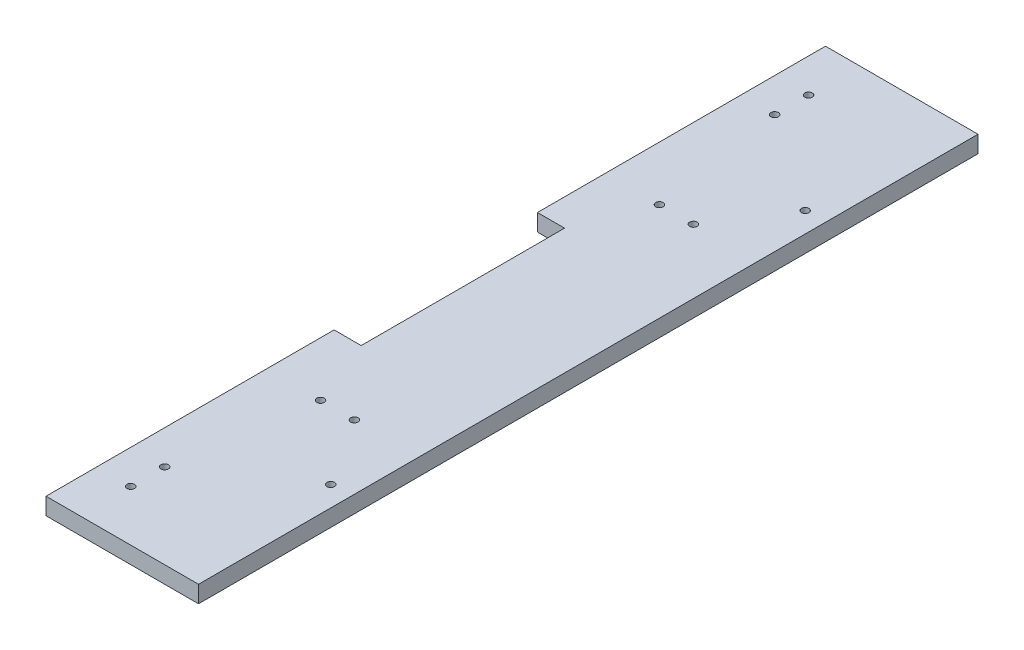
ISO-10303-21;
HEADER;
FILE_DESCRIPTION(('STEP AP214'),'2;1');
FILE_NAME('part.step','',(''),(''),'','','');
FILE_SCHEMA(('AUTOMOTIVE_DESIGN { 1 0 10303 214 1 1 1 1 }'));
ENDSEC;
DATA;
#1=APPLICATION_CONTEXT('core data for automotive mechanical design processes');
#2=APPLICATION_PROTOCOL_DEFINITION('international standard','automotive_design',2000,#1);
#3=PRODUCT_CONTEXT('',#1,'mechanical');
#4=PRODUCT('Part','Part','',(#3));
#5=PRODUCT_RELATED_PRODUCT_CATEGORY('part','',(#4));
#6=PRODUCT_DEFINITION_FORMATION('','',#4);
#7=PRODUCT_DEFINITION_CONTEXT('part definition',#1,'design');
#8=PRODUCT_DEFINITION('design','',#6,#7);
#9=PRODUCT_DEFINITION_SHAPE('','',#8);
#10=(LENGTH_UNIT() NAMED_UNIT(*) SI_UNIT(.MILLI.,.METRE.));
#11=(NAMED_UNIT(*) PLANE_ANGLE_UNIT() SI_UNIT($,.RADIAN.));
#12=(NAMED_UNIT(*) SI_UNIT($,.STERADIAN.) SOLID_ANGLE_UNIT());
#13=UNCERTAINTY_MEASURE_WITH_UNIT(LENGTH_MEASURE(1.E-05),#10,'distance_accuracy_value','');
#14=(GEOMETRIC_REPRESENTATION_CONTEXT(3) GLOBAL_UNCERTAINTY_ASSIGNED_CONTEXT((#13)) GLOBAL_UNIT_ASSIGNED_CONTEXT((#10,
#11,#12)) REPRESENTATION_CONTEXT('',''));
#15=CARTESIAN_POINT('',(0.,0.,0.));
#16=DIRECTION('',(0.,0.,1.));
#17=DIRECTION('',(1.,0.,0.));
#18=AXIS2_PLACEMENT_3D('',#15,#16,#17);
#19=CARTESIAN_POINT('',(-160.,0.,0.));
#20=DIRECTION('',(1.,0.,0.));
#21=DIRECTION('',(0.,0.,-1.));
#22=AXIS2_PLACEMENT_3D('',#19,#20,#21);
#23=PLANE('',#22);
#24=DIRECTION('',(0.,0.,-1.));
#25=VECTOR('',#24,1.);
#26=CARTESIAN_POINT('',(-160.,37.,115.));
#27=LINE('',#26,#25);
#28=CARTESIAN_POINT('',(-160.,37.,115.));
#29=VERTEX_POINT('',#28);
#30=CARTESIAN_POINT('',(-160.,37.0000000000001,30.));
#31=VERTEX_POINT('',#30);
#32=EDGE_CURVE('E219',#29,#31,#27,.T.);
#33=ORIENTED_EDGE('',*,*,#32,.T.);
#34=DIRECTION('',(0.,-1.,0.));
#35=VECTOR('',#34,1.);
#36=CARTESIAN_POINT('',(-160.,0.,30.));
#37=LINE('',#36,#35);
#38=CARTESIAN_POINT('',(-160.,31.999999999999,30.));
#39=VERTEX_POINT('',#38);
#40=EDGE_CURVE('E130',#31,#39,#37,.T.);
#41=ORIENTED_EDGE('',*,*,#40,.T.);
#42=DIRECTION('',(0.,0.,1.));
#43=VECTOR('',#42,1.);
#44=CARTESIAN_POINT('',(-160.,32.,-110.));
#45=LINE('',#44,#43);
#46=CARTESIAN_POINT('',(-160.,32.,115.));
#47=VERTEX_POINT('',#46);
#48=EDGE_CURVE('E213',#39,#47,#45,.T.);
#49=ORIENTED_EDGE('',*,*,#48,.T.);
#50=DIRECTION('',(0.,1.,0.));
#51=VECTOR('',#50,1.);
#52=CARTESIAN_POINT('',(-160.,0.,115.));
#53=LINE('',#52,#51);
#54=EDGE_CURVE('E216',#47,#29,#53,.T.);
#55=ORIENTED_EDGE('',*,*,#54,.T.);
#56=EDGE_LOOP('',(#33,#41,#49,#55));
#57=FACE_BOUND('',#56,.T.);
#58=ADVANCED_FACE('F37',(#57),#23,.F.);
#59=CARTESIAN_POINT('',(-110.,0.,-115.));
#60=DIRECTION('',(0.,0.,-1.));
#61=DIRECTION('',(-1.,0.,0.));
#62=AXIS2_PLACEMENT_3D('',#59,#60,#61);
#63=PLANE('',#62);
#64=DIRECTION('',(-1.,0.,0.));
#65=VECTOR('',#64,1.);
#66=CARTESIAN_POINT('',(-160.,32.,-115.));
#67=LINE('',#66,#65);
#68=CARTESIAN_POINT('',(-115.,32.,-115.));
#69=VERTEX_POINT('',#68);
#70=CARTESIAN_POINT('',(-160.,32.,-115.));
#71=VERTEX_POINT('',#70);
#72=EDGE_CURVE('E173',#69,#71,#67,.T.);
#73=ORIENTED_EDGE('',*,*,#72,.T.);
#74=DIRECTION('',(0.,-1.,0.));
#75=VECTOR('',#74,1.);
#76=CARTESIAN_POINT('',(-160.,0.,-115.));
#77=LINE('',#76,#75);
#78=CARTESIAN_POINT('',(-160.,37.,-115.));
#79=VERTEX_POINT('',#78);
#80=EDGE_CURVE('E207',#79,#71,#77,.T.);
#81=ORIENTED_EDGE('',*,*,#80,.F.);
#82=DIRECTION('',(1.,0.,0.));
#83=VECTOR('',#82,1.);
#84=CARTESIAN_POINT('',(-160.,37.,-115.));
#85=LINE('',#84,#83);
#86=CARTESIAN_POINT('',(-115.,37.,-115.));
#87=VERTEX_POINT('',#86);
#88=EDGE_CURVE('E210',#79,#87,#85,.T.);
#89=ORIENTED_EDGE('',*,*,#88,.T.);
#90=DIRECTION('',(0.,1.,0.));
#91=VECTOR('',#90,1.);
#92=CARTESIAN_POINT('',(-115.,-54.0487732352795,-115.));
#93=LINE('',#92,#91);
#94=EDGE_CURVE('E199',#69,#87,#93,.T.);
#95=ORIENTED_EDGE('',*,*,#94,.F.);
#96=EDGE_LOOP('',(#73,#81,#89,#95));
#97=FACE_BOUND('',#96,.T.);
#98=ADVANCED_FACE('F235',(#97),#63,.T.);
#99=CARTESIAN_POINT('',(-110.,0.,115.));
#100=DIRECTION('',(0.,0.,1.));
#101=DIRECTION('',(1.,0.,0.));
#102=AXIS2_PLACEMENT_3D('',#99,#100,#101);
#103=PLANE('',#102);
#104=DIRECTION('',(-1.,0.,0.));
#105=VECTOR('',#104,1.);
#106=CARTESIAN_POINT('',(-110.,32.,115.));
#107=LINE('',#106,#105);
#108=CARTESIAN_POINT('',(-115.,32.,115.));
#109=VERTEX_POINT('',#108);
#110=EDGE_CURVE('E196',#109,#47,#107,.T.);
#111=ORIENTED_EDGE('',*,*,#110,.F.);
#112=DIRECTION('',(0.,1.,0.));
#113=VECTOR('',#112,1.);
#114=CARTESIAN_POINT('',(-115.,-54.0487732352789,115.));
#115=LINE('',#114,#113);
#116=CARTESIAN_POINT('',(-115.,37.,115.));
#117=VERTEX_POINT('',#116);
#118=EDGE_CURVE('E200',#109,#117,#115,.T.);
#119=ORIENTED_EDGE('',*,*,#118,.T.);
#120=DIRECTION('',(1.,0.,0.));
#121=VECTOR('',#120,1.);
#122=CARTESIAN_POINT('',(-160.,37.,115.));
#123=LINE('',#122,#121);
#124=EDGE_CURVE('E45',#29,#117,#123,.T.);
#125=ORIENTED_EDGE('',*,*,#124,.F.);
#126=ORIENTED_EDGE('',*,*,#54,.F.);
#127=EDGE_LOOP('',(#111,#119,#125,#126));
#128=FACE_BOUND('',#127,.T.);
#129=ADVANCED_FACE('F39',(#128),#103,.T.);
#130=CARTESIAN_POINT('',(-160.,37.,115.));
#131=DIRECTION('',(0.,-1.,0.));
#132=DIRECTION('',(0.,0.,-1.));
#133=AXIS2_PLACEMENT_3D('',#130,#131,#132);
#134=PLANE('',#133);
#135=CARTESIAN_POINT('',(-134.,37.0000000000001,50.));
#136=DIRECTION('',(0.,1.,0.));
#137=DIRECTION('',(0.,0.,-1.));
#138=AXIS2_PLACEMENT_3D('',#135,#136,#137);
#139=CIRCLE('',#138,1.09999999999999);
#140=CARTESIAN_POINT('',(-134.,37.0000000000001,48.9000000000001));
#141=VERTEX_POINT('',#140);
#142=EDGE_CURVE('E133',#141,#141,#139,.T.);
#143=ORIENTED_EDGE('',*,*,#142,.F.);
#144=EDGE_LOOP('',(#143));
#145=FACE_BOUND('',#144,.T.);
#146=CARTESIAN_POINT('',(-144.,37.0000000000001,50.));
#147=DIRECTION('',(0.,1.,0.));
#148=DIRECTION('',(0.,0.,1.));
#149=AXIS2_PLACEMENT_3D('',#146,#147,#148);
#150=CIRCLE('',#149,1.09999999999999);
#151=CARTESIAN_POINT('',(-144.,37.0000000000001,51.1));
#152=VERTEX_POINT('',#151);
#153=EDGE_CURVE('E144',#152,#152,#150,.T.);
#154=ORIENTED_EDGE('',*,*,#153,.F.);
#155=EDGE_LOOP('',(#154));
#156=FACE_BOUND('',#155,.T.);
#157=CARTESIAN_POINT('',(-144.,37.0000000000002,-50.));
#158=DIRECTION('',(0.,1.,0.));
#159=DIRECTION('',(0.,0.,-1.));
#160=AXIS2_PLACEMENT_3D('',#157,#158,#159);
#161=CIRCLE('',#160,1.09999999999999);
#162=CARTESIAN_POINT('',(-144.,37.0000000000002,-51.0999999999999));
#163=VERTEX_POINT('',#162);
#164=EDGE_CURVE('E138',#163,#163,#161,.T.);
#165=ORIENTED_EDGE('',*,*,#164,.F.);
#166=EDGE_LOOP('',(#165));
#167=FACE_BOUND('',#166,.T.);
#168=CARTESIAN_POINT('',(-134.,37.0000000000002,-50.));
#169=DIRECTION('',(0.,1.,0.));
#170=DIRECTION('',(0.,0.,1.));
#171=AXIS2_PLACEMENT_3D('',#168,#169,#170);
#172=CIRCLE('',#171,1.09999999999999);
#173=CARTESIAN_POINT('',(-134.,37.0000000000002,-48.9));
#174=VERTEX_POINT('',#173);
#175=EDGE_CURVE('E137',#174,#174,#172,.T.);
#176=ORIENTED_EDGE('',*,*,#175,.F.);
#177=EDGE_LOOP('',(#176));
#178=FACE_BOUND('',#177,.T.);
#179=CARTESIAN_POINT('',(-121.,37.0000000000003,-70.));
#180=DIRECTION('',(0.,1.,0.));
#181=DIRECTION('',(0.,0.,1.));
#182=AXIS2_PLACEMENT_3D('',#179,#180,#181);
#183=CIRCLE('',#182,1.10000000000001);
#184=CARTESIAN_POINT('',(-121.,37.0000000000003,-68.8999999999999));
#185=VERTEX_POINT('',#184);
#186=EDGE_CURVE('E162',#185,#185,#183,.T.);
#187=ORIENTED_EDGE('',*,*,#186,.F.);
#188=EDGE_LOOP('',(#187));
#189=FACE_BOUND('',#188,.T.);
#190=CARTESIAN_POINT('',(-121.,37.0000000000001,69.9999999999999));
#191=DIRECTION('',(0.,1.,0.));
#192=DIRECTION('',(0.,0.,-1.));
#193=AXIS2_PLACEMENT_3D('',#190,#191,#192);
#194=CIRCLE('',#193,1.10000000000001);
#195=CARTESIAN_POINT('',(-121.,37.0000000000001,68.8999999999999));
#196=VERTEX_POINT('',#195);
#197=EDGE_CURVE('E155',#196,#196,#194,.T.);
#198=ORIENTED_EDGE('',*,*,#197,.F.);
#199=EDGE_LOOP('',(#198));
#200=FACE_BOUND('',#199,.T.);
#201=CARTESIAN_POINT('',(-150.,37.,100.));
#202=DIRECTION('',(0.,1.,0.));
#203=DIRECTION('',(0.,0.,1.));
#204=AXIS2_PLACEMENT_3D('',#201,#202,#203);
#205=CIRCLE('',#204,1.09999999999999);
#206=CARTESIAN_POINT('',(-150.,37.,101.1));
#207=VERTEX_POINT('',#206);
#208=EDGE_CURVE('E174',#207,#207,#205,.T.);
#209=ORIENTED_EDGE('',*,*,#208,.F.);
#210=EDGE_LOOP('',(#209));
#211=FACE_BOUND('',#210,.T.);
#212=CARTESIAN_POINT('',(-150.,37.,90.));
#213=DIRECTION('',(0.,1.,0.));
#214=DIRECTION('',(0.,0.,-1.));
#215=AXIS2_PLACEMENT_3D('',#212,#213,#214);
#216=CIRCLE('',#215,1.09999999999999);
#217=CARTESIAN_POINT('',(-150.,37.,88.9));
#218=VERTEX_POINT('',#217);
#219=EDGE_CURVE('E180',#218,#218,#216,.T.);
#220=ORIENTED_EDGE('',*,*,#219,.F.);
#221=EDGE_LOOP('',(#220));
#222=FACE_BOUND('',#221,.T.);
#223=CARTESIAN_POINT('',(-150.,37.0000000000003,-89.9999999999999));
#224=DIRECTION('',(0.,1.,0.));
#225=DIRECTION('',(0.,0.,1.));
#226=AXIS2_PLACEMENT_3D('',#223,#224,#225);
#227=CIRCLE('',#226,1.09999999999999);
#228=CARTESIAN_POINT('',(-150.,37.0000000000003,-88.8999999999999));
#229=VERTEX_POINT('',#228);
#230=EDGE_CURVE('E186',#229,#229,#227,.T.);
#231=ORIENTED_EDGE('',*,*,#230,.F.);
#232=EDGE_LOOP('',(#231));
#233=FACE_BOUND('',#232,.T.);
#234=CARTESIAN_POINT('',(-150.,37.0000000000003,-99.9999999999999));
#235=DIRECTION('',(0.,1.,0.));
#236=DIRECTION('',(0.,0.,-1.));
#237=AXIS2_PLACEMENT_3D('',#234,#235,#236);
#238=CIRCLE('',#237,1.09999999999999);
#239=CARTESIAN_POINT('',(-150.,37.0000000000003,-101.1));
#240=VERTEX_POINT('',#239);
#241=EDGE_CURVE('E161',#240,#240,#238,.T.);
#242=ORIENTED_EDGE('',*,*,#241,.F.);
#243=EDGE_LOOP('',(#242));
#244=FACE_BOUND('',#243,.T.);
#245=DIRECTION('',(0.,0.,-1.));
#246=VECTOR('',#245,1.);
#247=CARTESIAN_POINT('',(-152.,37.0000000000001,30.));
#248=LINE('',#247,#246);
#249=CARTESIAN_POINT('',(-152.,37.0000000000001,30.));
#250=VERTEX_POINT('',#249);
#251=CARTESIAN_POINT('',(-152.,37.0000000000002,-29.9999999999999));
#252=VERTEX_POINT('',#251);
#253=EDGE_CURVE('E109',#250,#252,#248,.T.);
#254=ORIENTED_EDGE('',*,*,#253,.F.);
#255=DIRECTION('',(1.,0.,0.));
#256=VECTOR('',#255,1.);
#257=CARTESIAN_POINT('',(-168.,37.0000000000001,30.));
#258=LINE('',#257,#256);
#259=EDGE_CURVE('E121',#31,#250,#258,.T.);
#260=ORIENTED_EDGE('',*,*,#259,.F.);
#261=ORIENTED_EDGE('',*,*,#32,.F.);
#262=ORIENTED_EDGE('',*,*,#124,.T.);
#263=DIRECTION('',(0.,0.,1.));
#264=VECTOR('',#263,1.);
#265=CARTESIAN_POINT('',(-115.,37.,-115.));
#266=LINE('',#265,#264);
#267=EDGE_CURVE('E204',#87,#117,#266,.T.);
#268=ORIENTED_EDGE('',*,*,#267,.F.);
#269=ORIENTED_EDGE('',*,*,#88,.F.);
#270=CARTESIAN_POINT('',(-160.,37.0000000000002,-29.9999999999999));
#271=VERTEX_POINT('',#270);
#272=EDGE_CURVE('E218',#271,#79,#27,.T.);
#273=ORIENTED_EDGE('',*,*,#272,.F.);
#274=DIRECTION('',(-1.,0.,0.));
#275=VECTOR('',#274,1.);
#276=CARTESIAN_POINT('',(-168.,37.0000000000002,-29.9999999999999));
#277=LINE('',#276,#275);
#278=EDGE_CURVE('E123',#252,#271,#277,.T.);
#279=ORIENTED_EDGE('',*,*,#278,.F.);
#280=EDGE_LOOP('',(#254,#260,#261,#262,#268,#269,#273,#279));
#281=FACE_BOUND('',#280,.T.);
#282=ADVANCED_FACE('F226',(#145,#156,#167,#178,#189,#200,#211,#222,#233,#244,#281),#134,.F.);
#283=CARTESIAN_POINT('',(-160.,32.,-30.));
#284=VERTEX_POINT('',#283);
#285=EDGE_CURVE('E214',#71,#284,#45,.T.);
#286=ORIENTED_EDGE('',*,*,#285,.T.);
#287=DIRECTION('',(0.,1.,0.));
#288=VECTOR('',#287,1.);
#289=CARTESIAN_POINT('',(-160.,0.,-30.));
#290=LINE('',#289,#288);
#291=EDGE_CURVE('E52',#284,#271,#290,.T.);
#292=ORIENTED_EDGE('',*,*,#291,.T.);
#293=ORIENTED_EDGE('',*,*,#272,.T.);
#294=ORIENTED_EDGE('',*,*,#80,.T.);
#295=EDGE_LOOP('',(#286,#292,#293,#294));
#296=FACE_BOUND('',#295,.T.);
#297=ADVANCED_FACE('F239',(#296),#23,.F.);
#298=CARTESIAN_POINT('',(-110.,32.,-110.));
#299=DIRECTION('',(0.,-1.,0.));
#300=DIRECTION('',(0.,0.,-1.));
#301=AXIS2_PLACEMENT_3D('',#298,#299,#300);
#302=PLANE('',#301);
#303=DIRECTION('',(-1.,0.,0.));
#304=VECTOR('',#303,1.);
#305=CARTESIAN_POINT('',(-110.,32.,30.));
#306=LINE('',#305,#304);
#307=CARTESIAN_POINT('',(-152.,31.999999999999,30.));
#308=VERTEX_POINT('',#307);
#309=EDGE_CURVE('E12',#308,#39,#306,.T.);
#310=ORIENTED_EDGE('',*,*,#309,.F.);
#311=DIRECTION('',(0.,0.,-1.));
#312=VECTOR('',#311,1.);
#313=CARTESIAN_POINT('',(-152.,31.999999999999,30.));
#314=LINE('',#313,#312);
#315=CARTESIAN_POINT('',(-152.,31.9999999999991,-30.));
#316=VERTEX_POINT('',#315);
#317=EDGE_CURVE('E106',#308,#316,#314,.T.);
#318=ORIENTED_EDGE('',*,*,#317,.T.);
#319=DIRECTION('',(-1.,0.,0.));
#320=VECTOR('',#319,1.);
#321=CARTESIAN_POINT('',(-168.,31.9999999999991,-30.));
#322=LINE('',#321,#320);
#323=EDGE_CURVE('E112',#316,#284,#322,.T.);
#324=ORIENTED_EDGE('',*,*,#323,.T.);
#325=ORIENTED_EDGE('',*,*,#285,.F.);
#326=ORIENTED_EDGE('',*,*,#72,.F.);
#327=DIRECTION('',(0.,0.,-1.));
#328=VECTOR('',#327,1.);
#329=CARTESIAN_POINT('',(-115.,32.,-110.));
#330=LINE('',#329,#328);
#331=EDGE_CURVE('E60',#109,#69,#330,.T.);
#332=ORIENTED_EDGE('',*,*,#331,.F.);
#333=ORIENTED_EDGE('',*,*,#110,.T.);
#334=ORIENTED_EDGE('',*,*,#48,.F.);
#335=EDGE_LOOP('',(#310,#318,#324,#325,#326,#332,#333,#334));
#336=FACE_BOUND('',#335,.T.);
#337=CARTESIAN_POINT('',(-134.,31.9999999999992,50.));
#338=DIRECTION('',(0.,1.,0.));
#339=DIRECTION('',(0.,0.,-1.));
#340=AXIS2_PLACEMENT_3D('',#337,#338,#339);
#341=CIRCLE('',#340,1.09999999999999);
#342=CARTESIAN_POINT('',(-134.,31.9999999999992,48.9000000000001));
#343=VERTEX_POINT('',#342);
#344=EDGE_CURVE('E147',#343,#343,#341,.T.);
#345=ORIENTED_EDGE('',*,*,#344,.T.);
#346=EDGE_LOOP('',(#345));
#347=FACE_BOUND('',#346,.T.);
#348=CARTESIAN_POINT('',(-144.,31.9999999999992,50.));
#349=DIRECTION('',(0.,1.,0.));
#350=DIRECTION('',(0.,0.,1.));
#351=AXIS2_PLACEMENT_3D('',#348,#349,#350);
#352=CIRCLE('',#351,1.09999999999999);
#353=CARTESIAN_POINT('',(-144.,31.9999999999992,51.1));
#354=VERTEX_POINT('',#353);
#355=EDGE_CURVE('E141',#354,#354,#352,.T.);
#356=ORIENTED_EDGE('',*,*,#355,.T.);
#357=EDGE_LOOP('',(#356));
#358=FACE_BOUND('',#357,.T.);
#359=CARTESIAN_POINT('',(-144.,31.9999999999994,-50.));
#360=DIRECTION('',(0.,1.,0.));
#361=DIRECTION('',(0.,0.,-1.));
#362=AXIS2_PLACEMENT_3D('',#359,#360,#361);
#363=CIRCLE('',#362,1.09999999999999);
#364=CARTESIAN_POINT('',(-144.,31.9999999999994,-51.1));
#365=VERTEX_POINT('',#364);
#366=EDGE_CURVE('E134',#365,#365,#363,.T.);
#367=ORIENTED_EDGE('',*,*,#366,.T.);
#368=EDGE_LOOP('',(#367));
#369=FACE_BOUND('',#368,.T.);
#370=CARTESIAN_POINT('',(-134.,31.9999999999994,-50.));
#371=DIRECTION('',(0.,1.,0.));
#372=DIRECTION('',(0.,0.,1.));
#373=AXIS2_PLACEMENT_3D('',#370,#371,#372);
#374=CIRCLE('',#373,1.09999999999999);
#375=CARTESIAN_POINT('',(-134.,31.9999999999994,-48.9));
#376=VERTEX_POINT('',#375);
#377=EDGE_CURVE('E152',#376,#376,#374,.T.);
#378=ORIENTED_EDGE('',*,*,#377,.T.);
#379=EDGE_LOOP('',(#378));
#380=FACE_BOUND('',#379,.T.);
#381=CARTESIAN_POINT('',(-121.,31.9999999999996,-70.));
#382=DIRECTION('',(0.,1.,0.));
#383=DIRECTION('',(0.,0.,1.));
#384=AXIS2_PLACEMENT_3D('',#381,#382,#383);
#385=CIRCLE('',#384,1.10000000000001);
#386=CARTESIAN_POINT('',(-121.,31.9999999999996,-68.9));
#387=VERTEX_POINT('',#386);
#388=EDGE_CURVE('E158',#387,#387,#385,.T.);
#389=ORIENTED_EDGE('',*,*,#388,.T.);
#390=EDGE_LOOP('',(#389));
#391=FACE_BOUND('',#390,.T.);
#392=CARTESIAN_POINT('',(-121.,31.9999999999994,69.9999999999999));
#393=DIRECTION('',(0.,1.,0.));
#394=DIRECTION('',(0.,0.,-1.));
#395=AXIS2_PLACEMENT_3D('',#392,#393,#394);
#396=CIRCLE('',#395,1.10000000000001);
#397=CARTESIAN_POINT('',(-121.,31.9999999999994,68.8999999999999));
#398=VERTEX_POINT('',#397);
#399=EDGE_CURVE('E165',#398,#398,#396,.T.);
#400=ORIENTED_EDGE('',*,*,#399,.T.);
#401=EDGE_LOOP('',(#400));
#402=FACE_BOUND('',#401,.T.);
#403=CARTESIAN_POINT('',(-150.,31.9999999999997,100.));
#404=DIRECTION('',(0.,1.,0.));
#405=DIRECTION('',(0.,0.,1.));
#406=AXIS2_PLACEMENT_3D('',#403,#404,#405);
#407=CIRCLE('',#406,1.09999999999999);
#408=CARTESIAN_POINT('',(-150.,31.9999999999997,101.1));
#409=VERTEX_POINT('',#408);
#410=EDGE_CURVE('E170',#409,#409,#407,.T.);
#411=ORIENTED_EDGE('',*,*,#410,.T.);
#412=EDGE_LOOP('',(#411));
#413=FACE_BOUND('',#412,.T.);
#414=CARTESIAN_POINT('',(-150.,31.9999999999997,90.));
#415=DIRECTION('',(0.,1.,0.));
#416=DIRECTION('',(0.,0.,-1.));
#417=AXIS2_PLACEMENT_3D('',#414,#415,#416);
#418=CIRCLE('',#417,1.09999999999999);
#419=CARTESIAN_POINT('',(-150.,31.9999999999997,88.9));
#420=VERTEX_POINT('',#419);
#421=EDGE_CURVE('E177',#420,#420,#418,.T.);
#422=ORIENTED_EDGE('',*,*,#421,.T.);
#423=EDGE_LOOP('',(#422));
#424=FACE_BOUND('',#423,.T.);
#425=CARTESIAN_POINT('',(-150.,32.,-89.9999999999999));
#426=DIRECTION('',(0.,1.,0.));
#427=DIRECTION('',(0.,0.,1.));
#428=AXIS2_PLACEMENT_3D('',#425,#426,#427);
#429=CIRCLE('',#428,1.09999999999999);
#430=CARTESIAN_POINT('',(-150.,32.,-88.8999999999999));
#431=VERTEX_POINT('',#430);
#432=EDGE_CURVE('E183',#431,#431,#429,.T.);
#433=ORIENTED_EDGE('',*,*,#432,.T.);
#434=EDGE_LOOP('',(#433));
#435=FACE_BOUND('',#434,.T.);
#436=CARTESIAN_POINT('',(-150.,32.,-99.9999999999999));
#437=DIRECTION('',(0.,1.,0.));
#438=DIRECTION('',(0.,0.,-1.));
#439=AXIS2_PLACEMENT_3D('',#436,#437,#438);
#440=CIRCLE('',#439,1.09999999999999);
#441=CARTESIAN_POINT('',(-150.,32.,-101.1));
#442=VERTEX_POINT('',#441);
#443=EDGE_CURVE('E189',#442,#442,#440,.T.);
#444=ORIENTED_EDGE('',*,*,#443,.T.);
#445=EDGE_LOOP('',(#444));
#446=FACE_BOUND('',#445,.T.);
#447=ADVANCED_FACE('F118',(#336,#347,#358,#369,#380,#391,#402,#413,#424,#435,#446),#302,.T.);
#448=CARTESIAN_POINT('',(-115.,-54.0487732352795,-115.));
#449=DIRECTION('',(-1.,0.,0.));
#450=DIRECTION('',(0.,0.,1.));
#451=AXIS2_PLACEMENT_3D('',#448,#449,#450);
#452=PLANE('',#451);
#453=ORIENTED_EDGE('',*,*,#118,.F.);
#454=ORIENTED_EDGE('',*,*,#331,.T.);
#455=ORIENTED_EDGE('',*,*,#94,.T.);
#456=ORIENTED_EDGE('',*,*,#267,.T.);
#457=EDGE_LOOP('',(#453,#454,#455,#456));
#458=FACE_BOUND('',#457,.T.);
#459=ADVANCED_FACE('F232',(#458),#452,.F.);
#460=CARTESIAN_POINT('',(-150.,32.,-99.9999999999999));
#461=DIRECTION('',(0.,1.,0.));
#462=DIRECTION('',(0.,0.,1.));
#463=AXIS2_PLACEMENT_3D('',#460,#461,#462);
#464=CYLINDRICAL_SURFACE('',#463,1.09999999999999);
#465=ORIENTED_EDGE('',*,*,#443,.F.);
#466=EDGE_LOOP('',(#465));
#467=FACE_BOUND('',#466,.T.);
#468=ORIENTED_EDGE('',*,*,#241,.T.);
#469=EDGE_LOOP('',(#468));
#470=FACE_BOUND('',#469,.T.);
#471=ADVANCED_FACE('F290',(#467,#470),#464,.F.);
#472=CARTESIAN_POINT('',(-150.,32.,-89.9999999999999));
#473=DIRECTION('',(0.,1.,0.));
#474=DIRECTION('',(0.,0.,1.));
#475=AXIS2_PLACEMENT_3D('',#472,#473,#474);
#476=CYLINDRICAL_SURFACE('',#475,1.09999999999999);
#477=ORIENTED_EDGE('',*,*,#432,.F.);
#478=EDGE_LOOP('',(#477));
#479=FACE_BOUND('',#478,.T.);
#480=ORIENTED_EDGE('',*,*,#230,.T.);
#481=EDGE_LOOP('',(#480));
#482=FACE_BOUND('',#481,.T.);
#483=ADVANCED_FACE('F292',(#479,#482),#476,.F.);
#484=CARTESIAN_POINT('',(-150.,31.9999999999997,90.));
#485=DIRECTION('',(0.,1.,0.));
#486=DIRECTION('',(0.,0.,1.));
#487=AXIS2_PLACEMENT_3D('',#484,#485,#486);
#488=CYLINDRICAL_SURFACE('',#487,1.09999999999999);
#489=ORIENTED_EDGE('',*,*,#421,.F.);
#490=EDGE_LOOP('',(#489));
#491=FACE_BOUND('',#490,.T.);
#492=ORIENTED_EDGE('',*,*,#219,.T.);
#493=EDGE_LOOP('',(#492));
#494=FACE_BOUND('',#493,.T.);
#495=ADVANCED_FACE('F299',(#491,#494),#488,.F.);
#496=CARTESIAN_POINT('',(-150.,31.9999999999997,100.));
#497=DIRECTION('',(0.,1.,0.));
#498=DIRECTION('',(0.,0.,1.));
#499=AXIS2_PLACEMENT_3D('',#496,#497,#498);
#500=CYLINDRICAL_SURFACE('',#499,1.09999999999999);
#501=ORIENTED_EDGE('',*,*,#410,.F.);
#502=EDGE_LOOP('',(#501));
#503=FACE_BOUND('',#502,.T.);
#504=ORIENTED_EDGE('',*,*,#208,.T.);
#505=EDGE_LOOP('',(#504));
#506=FACE_BOUND('',#505,.T.);
#507=ADVANCED_FACE('F307',(#503,#506),#500,.F.);
#508=CARTESIAN_POINT('',(-121.,31.9999999999994,69.9999999999999));
#509=DIRECTION('',(0.,1.,0.));
#510=DIRECTION('',(0.,0.,1.));
#511=AXIS2_PLACEMENT_3D('',#508,#509,#510);
#512=CYLINDRICAL_SURFACE('',#511,1.10000000000001);
#513=ORIENTED_EDGE('',*,*,#399,.F.);
#514=EDGE_LOOP('',(#513));
#515=FACE_BOUND('',#514,.T.);
#516=ORIENTED_EDGE('',*,*,#197,.T.);
#517=EDGE_LOOP('',(#516));
#518=FACE_BOUND('',#517,.T.);
#519=ADVANCED_FACE('F311',(#515,#518),#512,.F.);
#520=CARTESIAN_POINT('',(-121.,31.9999999999996,-70.));
#521=DIRECTION('',(0.,1.,0.));
#522=DIRECTION('',(0.,0.,1.));
#523=AXIS2_PLACEMENT_3D('',#520,#521,#522);
#524=CYLINDRICAL_SURFACE('',#523,1.10000000000001);
#525=ORIENTED_EDGE('',*,*,#388,.F.);
#526=EDGE_LOOP('',(#525));
#527=FACE_BOUND('',#526,.T.);
#528=ORIENTED_EDGE('',*,*,#186,.T.);
#529=EDGE_LOOP('',(#528));
#530=FACE_BOUND('',#529,.T.);
#531=ADVANCED_FACE('F315',(#527,#530),#524,.F.);
#532=CARTESIAN_POINT('',(-134.,31.9999999999994,-50.));
#533=DIRECTION('',(0.,1.,0.));
#534=DIRECTION('',(0.,0.,1.));
#535=AXIS2_PLACEMENT_3D('',#532,#533,#534);
#536=CYLINDRICAL_SURFACE('',#535,1.09999999999999);
#537=ORIENTED_EDGE('',*,*,#377,.F.);
#538=EDGE_LOOP('',(#537));
#539=FACE_BOUND('',#538,.T.);
#540=ORIENTED_EDGE('',*,*,#175,.T.);
#541=EDGE_LOOP('',(#540));
#542=FACE_BOUND('',#541,.T.);
#543=ADVANCED_FACE('F319',(#539,#542),#536,.F.);
#544=CARTESIAN_POINT('',(-144.,31.9999999999994,-50.));
#545=DIRECTION('',(0.,1.,0.));
#546=DIRECTION('',(0.,0.,1.));
#547=AXIS2_PLACEMENT_3D('',#544,#545,#546);
#548=CYLINDRICAL_SURFACE('',#547,1.09999999999999);
#549=ORIENTED_EDGE('',*,*,#366,.F.);
#550=EDGE_LOOP('',(#549));
#551=FACE_BOUND('',#550,.T.);
#552=ORIENTED_EDGE('',*,*,#164,.T.);
#553=EDGE_LOOP('',(#552));
#554=FACE_BOUND('',#553,.T.);
#555=ADVANCED_FACE('F322',(#551,#554),#548,.F.);
#556=CARTESIAN_POINT('',(-144.,31.9999999999992,50.));
#557=DIRECTION('',(0.,1.,0.));
#558=DIRECTION('',(0.,0.,1.));
#559=AXIS2_PLACEMENT_3D('',#556,#557,#558);
#560=CYLINDRICAL_SURFACE('',#559,1.09999999999999);
#561=ORIENTED_EDGE('',*,*,#355,.F.);
#562=EDGE_LOOP('',(#561));
#563=FACE_BOUND('',#562,.T.);
#564=ORIENTED_EDGE('',*,*,#153,.T.);
#565=EDGE_LOOP('',(#564));
#566=FACE_BOUND('',#565,.T.);
#567=ADVANCED_FACE('F251',(#563,#566),#560,.F.);
#568=CARTESIAN_POINT('',(-134.,31.9999999999992,50.));
#569=DIRECTION('',(0.,1.,0.));
#570=DIRECTION('',(0.,0.,1.));
#571=AXIS2_PLACEMENT_3D('',#568,#569,#570);
#572=CYLINDRICAL_SURFACE('',#571,1.09999999999999);
#573=ORIENTED_EDGE('',*,*,#344,.F.);
#574=EDGE_LOOP('',(#573));
#575=FACE_BOUND('',#574,.T.);
#576=ORIENTED_EDGE('',*,*,#142,.T.);
#577=EDGE_LOOP('',(#576));
#578=FACE_BOUND('',#577,.T.);
#579=ADVANCED_FACE('F244',(#575,#578),#572,.F.);
#580=CARTESIAN_POINT('',(-168.,31.999999999999,30.));
#581=DIRECTION('',(0.,0.,1.));
#582=DIRECTION('',(0.,-1.,0.));
#583=AXIS2_PLACEMENT_3D('',#580,#581,#582);
#584=PLANE('',#583);
#585=ORIENTED_EDGE('',*,*,#259,.T.);
#586=DIRECTION('',(0.,1.,0.));
#587=VECTOR('',#586,1.);
#588=CARTESIAN_POINT('',(-152.,31.999999999999,30.));
#589=LINE('',#588,#587);
#590=EDGE_CURVE('E111',#308,#250,#589,.T.);
#591=ORIENTED_EDGE('',*,*,#590,.F.);
#592=ORIENTED_EDGE('',*,*,#309,.T.);
#593=ORIENTED_EDGE('',*,*,#40,.F.);
#594=EDGE_LOOP('',(#585,#591,#592,#593));
#595=FACE_BOUND('',#594,.T.);
#596=ADVANCED_FACE('F242',(#595),#584,.F.);
#597=CARTESIAN_POINT('',(-168.,31.9999999999991,-30.));
#598=DIRECTION('',(0.,0.,-1.));
#599=DIRECTION('',(0.,1.,0.));
#600=AXIS2_PLACEMENT_3D('',#597,#598,#599);
#601=PLANE('',#600);
#602=ORIENTED_EDGE('',*,*,#323,.F.);
#603=DIRECTION('',(0.,1.,0.));
#604=VECTOR('',#603,1.);
#605=CARTESIAN_POINT('',(-152.,31.9999999999991,-30.));
#606=LINE('',#605,#604);
#607=EDGE_CURVE('E102',#316,#252,#606,.T.);
#608=ORIENTED_EDGE('',*,*,#607,.T.);
#609=ORIENTED_EDGE('',*,*,#278,.T.);
#610=ORIENTED_EDGE('',*,*,#291,.F.);
#611=EDGE_LOOP('',(#602,#608,#609,#610));
#612=FACE_BOUND('',#611,.T.);
#613=ADVANCED_FACE('F114',(#612),#601,.F.);
#614=CARTESIAN_POINT('',(-152.,31.999999999999,30.));
#615=DIRECTION('',(1.,0.,0.));
#616=DIRECTION('',(0.,0.,-1.));
#617=AXIS2_PLACEMENT_3D('',#614,#615,#616);
#618=PLANE('',#617);
#619=ORIENTED_EDGE('',*,*,#253,.T.);
#620=ORIENTED_EDGE('',*,*,#607,.F.);
#621=ORIENTED_EDGE('',*,*,#317,.F.);
#622=ORIENTED_EDGE('',*,*,#590,.T.);
#623=EDGE_LOOP('',(#619,#620,#621,#622));
#624=FACE_BOUND('',#623,.T.);
#625=ADVANCED_FACE('F103',(#624),#618,.F.);
#626=CLOSED_SHELL('',(#58,#98,#129,#282,#297,#447,#459,#471,#483,#495,#507,#519,#531,#543,#555,
#567,#579,#596,#613,#625));
#627=MANIFOLD_SOLID_BREP('B2',#626);
#628=ADVANCED_BREP_SHAPE_REPRESENTATION('',(#18,#627),#14);
#629=SHAPE_DEFINITION_REPRESENTATION(#9,#628);
ENDSEC;
END-ISO-10303-21;
